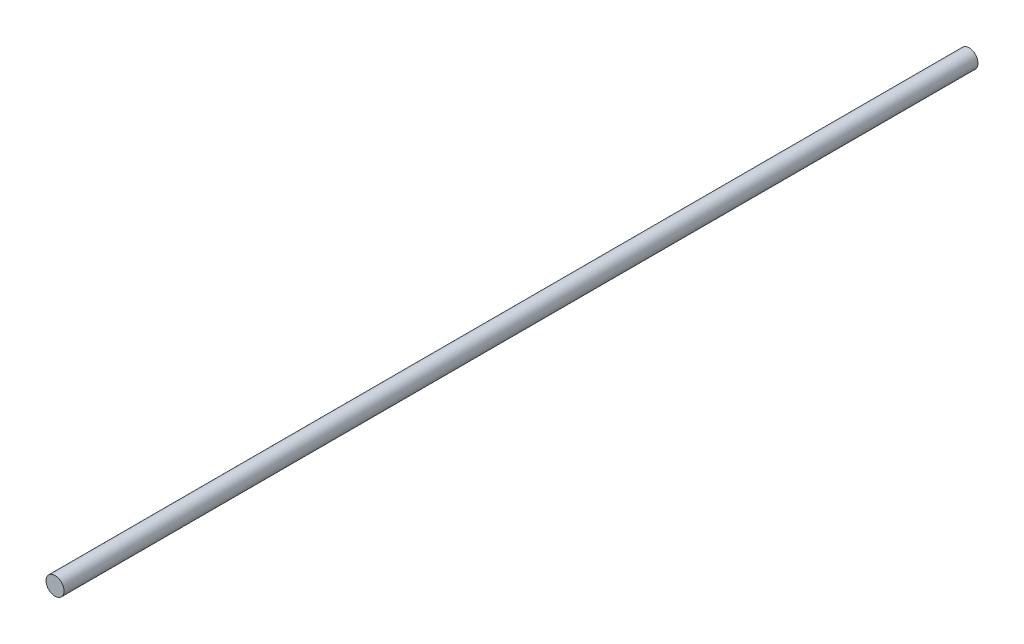
ISO-10303-21;
HEADER;
FILE_DESCRIPTION(('STEP AP214'),'2;1');
FILE_NAME('part.step','',(''),(''),'','','');
FILE_SCHEMA(('AUTOMOTIVE_DESIGN { 1 0 10303 214 1 1 1 1 }'));
ENDSEC;
DATA;
#1=APPLICATION_CONTEXT('core data for automotive mechanical design processes');
#2=APPLICATION_PROTOCOL_DEFINITION('international standard','automotive_design',2000,#1);
#3=PRODUCT_CONTEXT('',#1,'mechanical');
#4=PRODUCT('Part','Part','',(#3));
#5=PRODUCT_RELATED_PRODUCT_CATEGORY('part','',(#4));
#6=PRODUCT_DEFINITION_FORMATION('','',#4);
#7=PRODUCT_DEFINITION_CONTEXT('part definition',#1,'design');
#8=PRODUCT_DEFINITION('design','',#6,#7);
#9=PRODUCT_DEFINITION_SHAPE('','',#8);
#10=(LENGTH_UNIT() NAMED_UNIT(*) SI_UNIT(.MILLI.,.METRE.));
#11=(NAMED_UNIT(*) PLANE_ANGLE_UNIT() SI_UNIT($,.RADIAN.));
#12=(NAMED_UNIT(*) SI_UNIT($,.STERADIAN.) SOLID_ANGLE_UNIT());
#13=UNCERTAINTY_MEASURE_WITH_UNIT(LENGTH_MEASURE(1.E-05),#10,'distance_accuracy_value','');
#14=(GEOMETRIC_REPRESENTATION_CONTEXT(3) GLOBAL_UNCERTAINTY_ASSIGNED_CONTEXT((#13)) GLOBAL_UNIT_ASSIGNED_CONTEXT((#10,
#11,#12)) REPRESENTATION_CONTEXT('',''));
#15=CARTESIAN_POINT('',(0.,0.,0.));
#16=DIRECTION('',(0.,0.,1.));
#17=DIRECTION('',(1.,0.,0.));
#18=AXIS2_PLACEMENT_3D('',#15,#16,#17);
#19=CARTESIAN_POINT('',(0.,0.,-406.));
#20=DIRECTION('',(0.,0.,1.));
#21=DIRECTION('',(1.,0.,0.));
#22=AXIS2_PLACEMENT_3D('',#19,#20,#21);
#23=PLANE('',#22);
#24=CARTESIAN_POINT('',(0.,0.,-406.));
#25=DIRECTION('',(0.,0.,-1.));
#26=DIRECTION('',(-1.,0.,0.));
#27=AXIS2_PLACEMENT_3D('',#24,#25,#26);
#28=CIRCLE('',#27,4.);
#29=CARTESIAN_POINT('',(-4.,0.,-406.));
#30=VERTEX_POINT('',#29);
#31=EDGE_CURVE('E10',#30,#30,#28,.T.);
#32=ORIENTED_EDGE('',*,*,#31,.T.);
#33=EDGE_LOOP('',(#32));
#34=FACE_BOUND('',#33,.T.);
#35=ADVANCED_FACE('F29',(#34),#23,.F.);
#36=CARTESIAN_POINT('',(0.,0.,0.));
#37=DIRECTION('',(0.,0.,-1.));
#38=DIRECTION('',(-1.,0.,0.));
#39=AXIS2_PLACEMENT_3D('',#36,#37,#38);
#40=CYLINDRICAL_SURFACE('',#39,4.);
#41=ORIENTED_EDGE('',*,*,#31,.F.);
#42=EDGE_LOOP('',(#41));
#43=FACE_BOUND('',#42,.T.);
#44=CARTESIAN_POINT('',(0.,0.,0.));
#45=DIRECTION('',(0.,0.,-1.));
#46=DIRECTION('',(-1.,0.,0.));
#47=AXIS2_PLACEMENT_3D('',#44,#45,#46);
#48=CIRCLE('',#47,4.);
#49=CARTESIAN_POINT('',(-4.,0.,0.));
#50=VERTEX_POINT('',#49);
#51=EDGE_CURVE('E35',#50,#50,#48,.T.);
#52=ORIENTED_EDGE('',*,*,#51,.T.);
#53=EDGE_LOOP('',(#52));
#54=FACE_BOUND('',#53,.T.);
#55=ADVANCED_FACE('F41',(#43,#54),#40,.T.);
#56=CARTESIAN_POINT('',(0.,0.,0.));
#57=DIRECTION('',(0.,0.,-1.));
#58=DIRECTION('',(-1.,0.,0.));
#59=AXIS2_PLACEMENT_3D('',#56,#57,#58);
#60=PLANE('',#59);
#61=ORIENTED_EDGE('',*,*,#51,.F.);
#62=EDGE_LOOP('',(#61));
#63=FACE_BOUND('',#62,.T.);
#64=ADVANCED_FACE('F43',(#63),#60,.F.);
#65=CLOSED_SHELL('',(#35,#55,#64));
#66=MANIFOLD_SOLID_BREP('B2',#65);
#67=ADVANCED_BREP_SHAPE_REPRESENTATION('',(#18,#66),#14);
#68=SHAPE_DEFINITION_REPRESENTATION(#9,#67);
ENDSEC;
END-ISO-10303-21;
